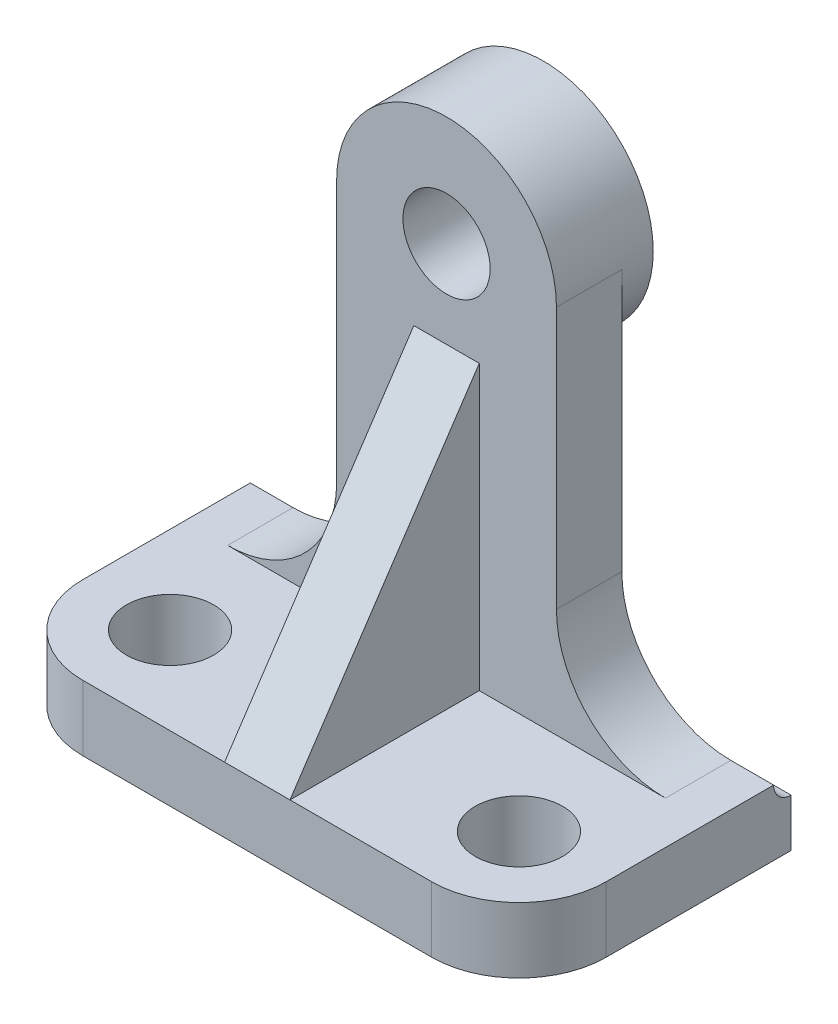
ISO-10303-21;
HEADER;
FILE_DESCRIPTION(('STEP AP214'),'2;1');
FILE_NAME('part.step','',(''),(''),'','','');
FILE_SCHEMA(('AUTOMOTIVE_DESIGN { 1 0 10303 214 1 1 1 1 }'));
ENDSEC;
DATA;
#1=APPLICATION_CONTEXT('core data for automotive mechanical design processes');
#2=APPLICATION_PROTOCOL_DEFINITION('international standard','automotive_design',2000,#1);
#3=PRODUCT_CONTEXT('',#1,'mechanical');
#4=PRODUCT('Part','Part','',(#3));
#5=PRODUCT_RELATED_PRODUCT_CATEGORY('part','',(#4));
#6=PRODUCT_DEFINITION_FORMATION('','',#4);
#7=PRODUCT_DEFINITION_CONTEXT('part definition',#1,'design');
#8=PRODUCT_DEFINITION('design','',#6,#7);
#9=PRODUCT_DEFINITION_SHAPE('','',#8);
#10=(LENGTH_UNIT() NAMED_UNIT(*) SI_UNIT(.MILLI.,.METRE.));
#11=(NAMED_UNIT(*) PLANE_ANGLE_UNIT() SI_UNIT($,.RADIAN.));
#12=(NAMED_UNIT(*) SI_UNIT($,.STERADIAN.) SOLID_ANGLE_UNIT());
#13=UNCERTAINTY_MEASURE_WITH_UNIT(LENGTH_MEASURE(1.E-05),#10,'distance_accuracy_value','');
#14=(GEOMETRIC_REPRESENTATION_CONTEXT(3) GLOBAL_UNCERTAINTY_ASSIGNED_CONTEXT((#13)) GLOBAL_UNIT_ASSIGNED_CONTEXT((#10,
#11,#12)) REPRESENTATION_CONTEXT('',''));
#15=CARTESIAN_POINT('',(0.,0.,0.));
#16=DIRECTION('',(0.,0.,1.));
#17=DIRECTION('',(1.,0.,0.));
#18=AXIS2_PLACEMENT_3D('',#15,#16,#17);
#19=CARTESIAN_POINT('',(38.1,0.,0.));
#20=DIRECTION('',(0.,-1.,0.));
#21=DIRECTION('',(0.,0.,-1.));
#22=AXIS2_PLACEMENT_3D('',#19,#20,#21);
#23=PLANE('',#22);
#24=CARTESIAN_POINT('',(25.4,0.,24.384));
#25=DIRECTION('',(0.,1.,0.));
#26=DIRECTION('',(0.,0.,1.));
#27=AXIS2_PLACEMENT_3D('',#24,#25,#26);
#28=CIRCLE('',#27,6.35);
#29=CARTESIAN_POINT('',(25.4,0.,30.734));
#30=VERTEX_POINT('',#29);
#31=EDGE_CURVE('E450',#30,#30,#28,.T.);
#32=ORIENTED_EDGE('',*,*,#31,.F.);
#33=EDGE_LOOP('',(#32));
#34=FACE_BOUND('',#33,.T.);
#35=DIRECTION('',(-1.,0.,0.));
#36=VECTOR('',#35,1.);
#37=CARTESIAN_POINT('',(38.1,0.,37.084));
#38=LINE('',#37,#36);
#39=CARTESIAN_POINT('',(25.4,0.,37.084));
#40=VERTEX_POINT('',#39);
#41=CARTESIAN_POINT('',(4.7625,0.,37.084));
#42=VERTEX_POINT('',#41);
#43=EDGE_CURVE('E262',#40,#42,#38,.T.);
#44=ORIENTED_EDGE('',*,*,#43,.F.);
#45=CARTESIAN_POINT('',(25.4,0.,24.384));
#46=DIRECTION('',(0.,-1.,0.));
#47=DIRECTION('',(0.,0.,-1.));
#48=AXIS2_PLACEMENT_3D('',#45,#46,#47);
#49=CIRCLE('',#48,12.7);
#50=CARTESIAN_POINT('',(38.1,0.,24.384));
#51=VERTEX_POINT('',#50);
#52=EDGE_CURVE('E11',#40,#51,#49,.F.);
#53=ORIENTED_EDGE('',*,*,#52,.T.);
#54=DIRECTION('',(0.,0.,1.));
#55=VECTOR('',#54,1.);
#56=CARTESIAN_POINT('',(38.1,0.,0.));
#57=LINE('',#56,#55);
#58=CARTESIAN_POINT('',(38.1,0.,0.));
#59=VERTEX_POINT('',#58);
#60=EDGE_CURVE('E228',#59,#51,#57,.T.);
#61=ORIENTED_EDGE('',*,*,#60,.F.);
#62=DIRECTION('',(-1.,0.,0.));
#63=VECTOR('',#62,1.);
#64=CARTESIAN_POINT('',(38.1,0.,0.));
#65=LINE('',#64,#63);
#66=CARTESIAN_POINT('',(31.877,0.,0.));
#67=VERTEX_POINT('',#66);
#68=EDGE_CURVE('E266',#59,#67,#65,.T.);
#69=ORIENTED_EDGE('',*,*,#68,.T.);
#70=DIRECTION('',(0.,0.,-1.));
#71=VECTOR('',#70,1.);
#72=CARTESIAN_POINT('',(31.877,0.,9.525));
#73=LINE('',#72,#71);
#74=CARTESIAN_POINT('',(31.877,0.,9.525));
#75=VERTEX_POINT('',#74);
#76=EDGE_CURVE('E285',#67,#75,#73,.F.);
#77=ORIENTED_EDGE('',*,*,#76,.T.);
#78=DIRECTION('',(1.,0.,0.));
#79=VECTOR('',#78,1.);
#80=CARTESIAN_POINT('',(-16.002,0.,9.525));
#81=LINE('',#80,#79);
#82=CARTESIAN_POINT('',(4.7625,0.,9.525));
#83=VERTEX_POINT('',#82);
#84=EDGE_CURVE('E196',#83,#75,#81,.T.);
#85=ORIENTED_EDGE('',*,*,#84,.F.);
#86=DIRECTION('',(0.,0.,-1.));
#87=VECTOR('',#86,1.);
#88=CARTESIAN_POINT('',(4.7625,0.,37.084));
#89=LINE('',#88,#87);
#90=EDGE_CURVE('E166',#42,#83,#89,.T.);
#91=ORIENTED_EDGE('',*,*,#90,.F.);
#92=EDGE_LOOP('',(#44,#53,#61,#69,#77,#85,#91));
#93=FACE_BOUND('',#92,.T.);
#94=ADVANCED_FACE('F40',(#34,#93),#23,.F.);
#95=CARTESIAN_POINT('',(0.,53.975,9.525));
#96=DIRECTION('',(0.,0.,-1.));
#97=DIRECTION('',(-1.,0.,0.));
#98=AXIS2_PLACEMENT_3D('',#95,#96,#97);
#99=PLANE('',#98);
#100=CARTESIAN_POINT('',(0.,53.975,9.525));
#101=DIRECTION('',(0.,0.,1.));
#102=DIRECTION('',(1.,0.,0.));
#103=AXIS2_PLACEMENT_3D('',#100,#101,#102);
#104=CIRCLE('',#103,6.34999999999999);
#105=CARTESIAN_POINT('',(6.34999999999999,53.975,9.525));
#106=VERTEX_POINT('',#105);
#107=EDGE_CURVE('E453',#106,#106,#104,.T.);
#108=ORIENTED_EDGE('',*,*,#107,.F.);
#109=EDGE_LOOP('',(#108));
#110=FACE_BOUND('',#109,.T.);
#111=DIRECTION('',(0.,1.,0.));
#112=VECTOR('',#111,1.);
#113=CARTESIAN_POINT('',(4.7625,0.,9.525));
#114=LINE('',#113,#112);
#115=CARTESIAN_POINT('',(4.7625,41.275,9.525));
#116=VERTEX_POINT('',#115);
#117=EDGE_CURVE('E167',#83,#116,#114,.T.);
#118=ORIENTED_EDGE('',*,*,#117,.F.);
#119=ORIENTED_EDGE('',*,*,#84,.T.);
#120=CARTESIAN_POINT('',(31.877,15.875,9.525));
#121=DIRECTION('',(0.,0.,-1.));
#122=DIRECTION('',(-1.,0.,0.));
#123=AXIS2_PLACEMENT_3D('',#120,#121,#122);
#124=CIRCLE('',#123,15.875);
#125=CARTESIAN_POINT('',(16.002,15.875,9.525));
#126=VERTEX_POINT('',#125);
#127=EDGE_CURVE('E300',#75,#126,#124,.T.);
#128=ORIENTED_EDGE('',*,*,#127,.T.);
#129=DIRECTION('',(0.,1.,0.));
#130=VECTOR('',#129,1.);
#131=CARTESIAN_POINT('',(16.002,53.975,9.525));
#132=LINE('',#131,#130);
#133=CARTESIAN_POINT('',(16.002,53.975,9.525));
#134=VERTEX_POINT('',#133);
#135=EDGE_CURVE('E201',#126,#134,#132,.T.);
#136=ORIENTED_EDGE('',*,*,#135,.T.);
#137=CARTESIAN_POINT('',(0.,53.975,9.525));
#138=DIRECTION('',(0.,0.,1.));
#139=DIRECTION('',(-1.,0.,0.));
#140=AXIS2_PLACEMENT_3D('',#137,#138,#139);
#141=CIRCLE('',#140,16.002);
#142=CARTESIAN_POINT('',(-16.002,53.975,9.525));
#143=VERTEX_POINT('',#142);
#144=EDGE_CURVE('E204',#134,#143,#141,.T.);
#145=ORIENTED_EDGE('',*,*,#144,.T.);
#146=DIRECTION('',(0.,-1.,0.));
#147=VECTOR('',#146,1.);
#148=CARTESIAN_POINT('',(-16.002,0.,9.525));
#149=LINE('',#148,#147);
#150=CARTESIAN_POINT('',(-16.002,15.875,9.525));
#151=VERTEX_POINT('',#150);
#152=EDGE_CURVE('E192',#143,#151,#149,.T.);
#153=ORIENTED_EDGE('',*,*,#152,.T.);
#154=CARTESIAN_POINT('',(-31.877,15.875,9.525));
#155=DIRECTION('',(0.,0.,-1.));
#156=DIRECTION('',(-1.,0.,0.));
#157=AXIS2_PLACEMENT_3D('',#154,#155,#156);
#158=CIRCLE('',#157,15.875);
#159=CARTESIAN_POINT('',(-31.877,0.,9.525));
#160=VERTEX_POINT('',#159);
#161=EDGE_CURVE('E292',#151,#160,#158,.T.);
#162=ORIENTED_EDGE('',*,*,#161,.T.);
#163=CARTESIAN_POINT('',(-4.7625,0.,9.525));
#164=VERTEX_POINT('',#163);
#165=EDGE_CURVE('E198',#160,#164,#81,.T.);
#166=ORIENTED_EDGE('',*,*,#165,.T.);
#167=DIRECTION('',(0.,1.,0.));
#168=VECTOR('',#167,1.);
#169=CARTESIAN_POINT('',(-4.7625,0.,9.525));
#170=LINE('',#169,#168);
#171=CARTESIAN_POINT('',(-4.7625,41.275,9.525));
#172=VERTEX_POINT('',#171);
#173=EDGE_CURVE('E179',#164,#172,#170,.T.);
#174=ORIENTED_EDGE('',*,*,#173,.T.);
#175=DIRECTION('',(-1.,0.,0.));
#176=VECTOR('',#175,1.);
#177=CARTESIAN_POINT('',(4.7625,41.275,9.525));
#178=LINE('',#177,#176);
#179=EDGE_CURVE('E159',#116,#172,#178,.T.);
#180=ORIENTED_EDGE('',*,*,#179,.F.);
#181=EDGE_LOOP('',(#118,#119,#128,#136,#145,#153,#162,#166,#174,#180));
#182=FACE_BOUND('',#181,.T.);
#183=ADVANCED_FACE('F177',(#110,#182),#99,.F.);
#184=CARTESIAN_POINT('',(0.,53.975,0.));
#185=DIRECTION('',(0.,0.,-1.));
#186=DIRECTION('',(-1.,0.,0.));
#187=AXIS2_PLACEMENT_3D('',#184,#185,#186);
#188=PLANE('',#187);
#189=DIRECTION('',(0.,-1.,0.));
#190=VECTOR('',#189,1.);
#191=CARTESIAN_POINT('',(-16.002,0.,0.));
#192=LINE('',#191,#190);
#193=CARTESIAN_POINT('',(-16.002,53.975,0.));
#194=VERTEX_POINT('',#193);
#195=CARTESIAN_POINT('',(-16.002,15.875,0.));
#196=VERTEX_POINT('',#195);
#197=EDGE_CURVE('E187',#194,#196,#192,.T.);
#198=ORIENTED_EDGE('',*,*,#197,.F.);
#199=CARTESIAN_POINT('',(0.,53.975,0.));
#200=DIRECTION('',(0.,0.,-1.));
#201=DIRECTION('',(-1.,0.,0.));
#202=AXIS2_PLACEMENT_3D('',#199,#200,#201);
#203=CIRCLE('',#202,16.002);
#204=CARTESIAN_POINT('',(16.002,53.975,0.));
#205=VERTEX_POINT('',#204);
#206=EDGE_CURVE('E270',#194,#205,#203,.F.);
#207=ORIENTED_EDGE('',*,*,#206,.T.);
#208=DIRECTION('',(0.,1.,0.));
#209=VECTOR('',#208,1.);
#210=CARTESIAN_POINT('',(16.002,53.975,0.));
#211=LINE('',#210,#209);
#212=CARTESIAN_POINT('',(16.002,15.875,0.));
#213=VERTEX_POINT('',#212);
#214=EDGE_CURVE('E197',#213,#205,#211,.T.);
#215=ORIENTED_EDGE('',*,*,#214,.F.);
#216=CARTESIAN_POINT('',(31.877,15.875,0.));
#217=DIRECTION('',(0.,0.,-1.));
#218=DIRECTION('',(-1.,0.,0.));
#219=AXIS2_PLACEMENT_3D('',#216,#217,#218);
#220=CIRCLE('',#219,15.875);
#221=EDGE_CURVE('E296',#213,#67,#220,.F.);
#222=ORIENTED_EDGE('',*,*,#221,.T.);
#223=DIRECTION('',(1.,0.,0.));
#224=VECTOR('',#223,1.);
#225=CARTESIAN_POINT('',(-16.002,0.,0.));
#226=LINE('',#225,#224);
#227=CARTESIAN_POINT('',(-31.877,0.,0.));
#228=VERTEX_POINT('',#227);
#229=EDGE_CURVE('E211',#228,#67,#226,.T.);
#230=ORIENTED_EDGE('',*,*,#229,.F.);
#231=CARTESIAN_POINT('',(-31.877,15.875,0.));
#232=DIRECTION('',(0.,0.,-1.));
#233=DIRECTION('',(-1.,0.,0.));
#234=AXIS2_PLACEMENT_3D('',#231,#232,#233);
#235=CIRCLE('',#234,15.875);
#236=EDGE_CURVE('E289',#228,#196,#235,.F.);
#237=ORIENTED_EDGE('',*,*,#236,.T.);
#238=EDGE_LOOP('',(#198,#207,#215,#222,#230,#237));
#239=FACE_BOUND('',#238,.T.);
#240=ADVANCED_FACE('F347',(#239),#188,.T.);
#241=CARTESIAN_POINT('',(-25.4,0.,24.384));
#242=DIRECTION('',(0.,1.,0.));
#243=DIRECTION('',(0.,0.,1.));
#244=AXIS2_PLACEMENT_3D('',#241,#242,#243);
#245=CIRCLE('',#244,6.35);
#246=CARTESIAN_POINT('',(-25.4,0.,30.734));
#247=VERTEX_POINT('',#246);
#248=EDGE_CURVE('E440',#247,#247,#245,.T.);
#249=ORIENTED_EDGE('',*,*,#248,.F.);
#250=EDGE_LOOP('',(#249));
#251=FACE_BOUND('',#250,.T.);
#252=DIRECTION('',(0.,0.,1.));
#253=VECTOR('',#252,1.);
#254=CARTESIAN_POINT('',(-38.1,0.,0.));
#255=LINE('',#254,#253);
#256=CARTESIAN_POINT('',(-38.1,0.,0.));
#257=VERTEX_POINT('',#256);
#258=CARTESIAN_POINT('',(-38.1,0.,24.384));
#259=VERTEX_POINT('',#258);
#260=EDGE_CURVE('E242',#257,#259,#255,.T.);
#261=ORIENTED_EDGE('',*,*,#260,.T.);
#262=CARTESIAN_POINT('',(-25.4,0.,24.384));
#263=DIRECTION('',(0.,-1.,0.));
#264=DIRECTION('',(0.,0.,-1.));
#265=AXIS2_PLACEMENT_3D('',#262,#263,#264);
#266=CIRCLE('',#265,12.7);
#267=CARTESIAN_POINT('',(-25.4,0.,37.084));
#268=VERTEX_POINT('',#267);
#269=EDGE_CURVE('E318',#259,#268,#266,.F.);
#270=ORIENTED_EDGE('',*,*,#269,.T.);
#271=CARTESIAN_POINT('',(-4.7625,0.,37.084));
#272=VERTEX_POINT('',#271);
#273=EDGE_CURVE('E261',#272,#268,#38,.T.);
#274=ORIENTED_EDGE('',*,*,#273,.F.);
#275=DIRECTION('',(0.,0.,-1.));
#276=VECTOR('',#275,1.);
#277=CARTESIAN_POINT('',(-4.7625,0.,37.084));
#278=LINE('',#277,#276);
#279=EDGE_CURVE('E174',#272,#164,#278,.T.);
#280=ORIENTED_EDGE('',*,*,#279,.T.);
#281=ORIENTED_EDGE('',*,*,#165,.F.);
#282=DIRECTION('',(0.,0.,-1.));
#283=VECTOR('',#282,1.);
#284=CARTESIAN_POINT('',(-31.877,0.,0.));
#285=LINE('',#284,#283);
#286=EDGE_CURVE('E274',#160,#228,#285,.T.);
#287=ORIENTED_EDGE('',*,*,#286,.T.);
#288=EDGE_CURVE('E265',#228,#257,#65,.T.);
#289=ORIENTED_EDGE('',*,*,#288,.T.);
#290=EDGE_LOOP('',(#261,#270,#274,#280,#281,#287,#289));
#291=FACE_BOUND('',#290,.T.);
#292=ADVANCED_FACE('F369',(#251,#291),#23,.F.);
#293=CARTESIAN_POINT('',(38.1,0.,-2.54));
#294=DIRECTION('',(-1.,0.,0.));
#295=DIRECTION('',(0.,0.,1.));
#296=AXIS2_PLACEMENT_3D('',#293,#294,#295);
#297=CYLINDRICAL_SURFACE('',#296,2.54);
#298=CARTESIAN_POINT('',(-38.1,0.,-2.54));
#299=DIRECTION('',(-1.,0.,0.));
#300=DIRECTION('',(0.,0.,1.));
#301=AXIS2_PLACEMENT_3D('',#298,#299,#300);
#302=CIRCLE('',#301,2.54);
#303=CARTESIAN_POINT('',(-38.1,-2.54,-2.54));
#304=VERTEX_POINT('',#303);
#305=EDGE_CURVE('E223',#304,#257,#302,.T.);
#306=ORIENTED_EDGE('',*,*,#305,.T.);
#307=ORIENTED_EDGE('',*,*,#288,.F.);
#308=ORIENTED_EDGE('',*,*,#229,.T.);
#309=ORIENTED_EDGE('',*,*,#68,.F.);
#310=CARTESIAN_POINT('',(38.1,0.,-2.54));
#311=DIRECTION('',(-1.,0.,0.));
#312=DIRECTION('',(0.,0.,1.));
#313=AXIS2_PLACEMENT_3D('',#310,#311,#312);
#314=CIRCLE('',#313,2.54);
#315=CARTESIAN_POINT('',(38.1,-2.54,-2.54));
#316=VERTEX_POINT('',#315);
#317=EDGE_CURVE('E224',#316,#59,#314,.T.);
#318=ORIENTED_EDGE('',*,*,#317,.F.);
#319=DIRECTION('',(-1.,0.,0.));
#320=VECTOR('',#319,1.);
#321=CARTESIAN_POINT('',(38.1,-2.54,-2.54));
#322=LINE('',#321,#320);
#323=EDGE_CURVE('E238',#316,#304,#322,.T.);
#324=ORIENTED_EDGE('',*,*,#323,.T.);
#325=EDGE_LOOP('',(#306,#307,#308,#309,#318,#324));
#326=FACE_BOUND('',#325,.T.);
#327=ADVANCED_FACE('F340',(#326),#297,.F.);
#328=CARTESIAN_POINT('',(38.1,0.,37.084));
#329=DIRECTION('',(0.,0.,-1.));
#330=DIRECTION('',(-1.,0.,0.));
#331=AXIS2_PLACEMENT_3D('',#328,#329,#330);
#332=PLANE('',#331);
#333=ORIENTED_EDGE('',*,*,#273,.T.);
#334=DIRECTION('',(0.,-1.,0.));
#335=VECTOR('',#334,1.);
#336=CARTESIAN_POINT('',(-25.4,-9.525,37.084));
#337=LINE('',#336,#335);
#338=CARTESIAN_POINT('',(-25.4,-9.525,37.084));
#339=VERTEX_POINT('',#338);
#340=EDGE_CURVE('E306',#268,#339,#337,.T.);
#341=ORIENTED_EDGE('',*,*,#340,.T.);
#342=DIRECTION('',(-1.,0.,0.));
#343=VECTOR('',#342,1.);
#344=CARTESIAN_POINT('',(38.1,-9.525,37.084));
#345=LINE('',#344,#343);
#346=CARTESIAN_POINT('',(25.4,-9.525,37.084));
#347=VERTEX_POINT('',#346);
#348=EDGE_CURVE('E257',#347,#339,#345,.T.);
#349=ORIENTED_EDGE('',*,*,#348,.F.);
#350=DIRECTION('',(0.,-1.,0.));
#351=VECTOR('',#350,1.);
#352=CARTESIAN_POINT('',(25.4,0.,37.084));
#353=LINE('',#352,#351);
#354=EDGE_CURVE('E303',#347,#40,#353,.F.);
#355=ORIENTED_EDGE('',*,*,#354,.T.);
#356=ORIENTED_EDGE('',*,*,#43,.T.);
#357=DIRECTION('',(-1.,0.,0.));
#358=VECTOR('',#357,1.);
#359=CARTESIAN_POINT('',(4.7625,0.,37.084));
#360=LINE('',#359,#358);
#361=EDGE_CURVE('E162',#42,#272,#360,.T.);
#362=ORIENTED_EDGE('',*,*,#361,.T.);
#363=EDGE_LOOP('',(#333,#341,#349,#355,#356,#362));
#364=FACE_BOUND('',#363,.T.);
#365=ADVANCED_FACE('F405',(#364),#332,.F.);
#366=CARTESIAN_POINT('',(38.1,-9.525,37.084));
#367=DIRECTION('',(0.,1.,0.));
#368=DIRECTION('',(0.,0.,1.));
#369=AXIS2_PLACEMENT_3D('',#366,#367,#368);
#370=PLANE('',#369);
#371=CARTESIAN_POINT('',(-25.4,-9.525,24.384));
#372=DIRECTION('',(0.,1.,0.));
#373=DIRECTION('',(0.,0.,1.));
#374=AXIS2_PLACEMENT_3D('',#371,#372,#373);
#375=CIRCLE('',#374,6.35);
#376=CARTESIAN_POINT('',(-25.4,-9.525,30.734));
#377=VERTEX_POINT('',#376);
#378=EDGE_CURVE('E443',#377,#377,#375,.T.);
#379=ORIENTED_EDGE('',*,*,#378,.T.);
#380=EDGE_LOOP('',(#379));
#381=FACE_BOUND('',#380,.T.);
#382=CARTESIAN_POINT('',(25.4,-9.525,24.384));
#383=DIRECTION('',(0.,1.,0.));
#384=DIRECTION('',(0.,0.,1.));
#385=AXIS2_PLACEMENT_3D('',#382,#383,#384);
#386=CIRCLE('',#385,6.35);
#387=CARTESIAN_POINT('',(25.4,-9.525,30.734));
#388=VERTEX_POINT('',#387);
#389=EDGE_CURVE('E460',#388,#388,#386,.T.);
#390=ORIENTED_EDGE('',*,*,#389,.T.);
#391=EDGE_LOOP('',(#390));
#392=FACE_BOUND('',#391,.T.);
#393=ORIENTED_EDGE('',*,*,#348,.T.);
#394=CARTESIAN_POINT('',(-25.4,-9.525,24.384));
#395=DIRECTION('',(0.,1.,0.));
#396=DIRECTION('',(0.,0.,1.));
#397=AXIS2_PLACEMENT_3D('',#394,#395,#396);
#398=CIRCLE('',#397,12.7);
#399=CARTESIAN_POINT('',(-38.1,-9.525,24.384));
#400=VERTEX_POINT('',#399);
#401=EDGE_CURVE('E313',#339,#400,#398,.F.);
#402=ORIENTED_EDGE('',*,*,#401,.T.);
#403=DIRECTION('',(0.,0.,-1.));
#404=VECTOR('',#403,1.);
#405=CARTESIAN_POINT('',(-38.1,-9.525,37.084));
#406=LINE('',#405,#404);
#407=CARTESIAN_POINT('',(-38.1,-9.525,-2.54));
#408=VERTEX_POINT('',#407);
#409=EDGE_CURVE('E245',#400,#408,#406,.T.);
#410=ORIENTED_EDGE('',*,*,#409,.T.);
#411=DIRECTION('',(-1.,0.,0.));
#412=VECTOR('',#411,1.);
#413=CARTESIAN_POINT('',(38.1,-9.525,-2.54));
#414=LINE('',#413,#412);
#415=CARTESIAN_POINT('',(38.1,-9.525,-2.54));
#416=VERTEX_POINT('',#415);
#417=EDGE_CURVE('E253',#416,#408,#414,.T.);
#418=ORIENTED_EDGE('',*,*,#417,.F.);
#419=DIRECTION('',(0.,0.,-1.));
#420=VECTOR('',#419,1.);
#421=CARTESIAN_POINT('',(38.1,-9.525,37.084));
#422=LINE('',#421,#420);
#423=CARTESIAN_POINT('',(38.1,-9.525,24.384));
#424=VERTEX_POINT('',#423);
#425=EDGE_CURVE('E232',#424,#416,#422,.T.);
#426=ORIENTED_EDGE('',*,*,#425,.F.);
#427=CARTESIAN_POINT('',(25.4,-9.525,24.384));
#428=DIRECTION('',(0.,1.,0.));
#429=DIRECTION('',(0.,0.,1.));
#430=AXIS2_PLACEMENT_3D('',#427,#428,#429);
#431=CIRCLE('',#430,12.7);
#432=EDGE_CURVE('E310',#424,#347,#431,.F.);
#433=ORIENTED_EDGE('',*,*,#432,.T.);
#434=EDGE_LOOP('',(#393,#402,#410,#418,#426,#433));
#435=FACE_BOUND('',#434,.T.);
#436=ADVANCED_FACE('F330',(#381,#392,#435),#370,.F.);
#437=CARTESIAN_POINT('',(38.1,-9.525,-2.54));
#438=DIRECTION('',(0.,0.,1.));
#439=DIRECTION('',(1.,0.,0.));
#440=AXIS2_PLACEMENT_3D('',#437,#438,#439);
#441=PLANE('',#440);
#442=DIRECTION('',(0.,1.,0.));
#443=VECTOR('',#442,1.);
#444=CARTESIAN_POINT('',(-38.1,-9.525,-2.54));
#445=LINE('',#444,#443);
#446=EDGE_CURVE('E229',#408,#304,#445,.T.);
#447=ORIENTED_EDGE('',*,*,#446,.T.);
#448=ORIENTED_EDGE('',*,*,#323,.F.);
#449=DIRECTION('',(0.,1.,0.));
#450=VECTOR('',#449,1.);
#451=CARTESIAN_POINT('',(38.1,-9.525,-2.54));
#452=LINE('',#451,#450);
#453=EDGE_CURVE('E235',#416,#316,#452,.T.);
#454=ORIENTED_EDGE('',*,*,#453,.F.);
#455=ORIENTED_EDGE('',*,*,#417,.T.);
#456=EDGE_LOOP('',(#447,#448,#454,#455));
#457=FACE_BOUND('',#456,.T.);
#458=ADVANCED_FACE('F336',(#457),#441,.F.);
#459=CARTESIAN_POINT('',(38.1,0.,-2.54));
#460=DIRECTION('',(-1.,0.,0.));
#461=DIRECTION('',(0.,0.,1.));
#462=AXIS2_PLACEMENT_3D('',#459,#460,#461);
#463=PLANE('',#462);
#464=ORIENTED_EDGE('',*,*,#60,.T.);
#465=DIRECTION('',(0.,-1.,0.));
#466=VECTOR('',#465,1.);
#467=CARTESIAN_POINT('',(38.1,0.,24.384));
#468=LINE('',#467,#466);
#469=EDGE_CURVE('E49',#51,#424,#468,.T.);
#470=ORIENTED_EDGE('',*,*,#469,.T.);
#471=ORIENTED_EDGE('',*,*,#425,.T.);
#472=ORIENTED_EDGE('',*,*,#453,.T.);
#473=ORIENTED_EDGE('',*,*,#317,.T.);
#474=EDGE_LOOP('',(#464,#470,#471,#472,#473));
#475=FACE_BOUND('',#474,.T.);
#476=ADVANCED_FACE('F326',(#475),#463,.F.);
#477=CARTESIAN_POINT('',(-38.1,0.,-2.54));
#478=DIRECTION('',(-1.,0.,0.));
#479=DIRECTION('',(0.,0.,1.));
#480=AXIS2_PLACEMENT_3D('',#477,#478,#479);
#481=PLANE('',#480);
#482=ORIENTED_EDGE('',*,*,#409,.F.);
#483=DIRECTION('',(0.,-1.,0.));
#484=VECTOR('',#483,1.);
#485=CARTESIAN_POINT('',(-38.1,0.,24.384));
#486=LINE('',#485,#484);
#487=EDGE_CURVE('E62',#400,#259,#486,.F.);
#488=ORIENTED_EDGE('',*,*,#487,.T.);
#489=ORIENTED_EDGE('',*,*,#260,.F.);
#490=ORIENTED_EDGE('',*,*,#305,.F.);
#491=ORIENTED_EDGE('',*,*,#446,.F.);
#492=EDGE_LOOP('',(#482,#488,#489,#490,#491));
#493=FACE_BOUND('',#492,.T.);
#494=ADVANCED_FACE('F409',(#493),#481,.T.);
#495=CARTESIAN_POINT('',(-16.002,0.,9.525));
#496=DIRECTION('',(1.,0.,0.));
#497=DIRECTION('',(0.,1.,0.));
#498=AXIS2_PLACEMENT_3D('',#495,#496,#497);
#499=PLANE('',#498);
#500=ORIENTED_EDGE('',*,*,#197,.T.);
#501=DIRECTION('',(0.,0.,-1.));
#502=VECTOR('',#501,1.);
#503=CARTESIAN_POINT('',(-16.002,15.875,9.525));
#504=LINE('',#503,#502);
#505=EDGE_CURVE('E278',#196,#151,#504,.F.);
#506=ORIENTED_EDGE('',*,*,#505,.T.);
#507=ORIENTED_EDGE('',*,*,#152,.F.);
#508=DIRECTION('',(0.,0.,-1.));
#509=VECTOR('',#508,1.);
#510=CARTESIAN_POINT('',(-16.002,53.975,9.525));
#511=LINE('',#510,#509);
#512=EDGE_CURVE('E207',#143,#194,#511,.T.);
#513=ORIENTED_EDGE('',*,*,#512,.T.);
#514=EDGE_LOOP('',(#500,#506,#507,#513));
#515=FACE_BOUND('',#514,.T.);
#516=ADVANCED_FACE('F411',(#515),#499,.F.);
#517=CARTESIAN_POINT('',(16.002,53.975,9.525));
#518=DIRECTION('',(-1.,0.,0.));
#519=DIRECTION('',(0.,-1.,0.));
#520=AXIS2_PLACEMENT_3D('',#517,#518,#519);
#521=PLANE('',#520);
#522=ORIENTED_EDGE('',*,*,#135,.F.);
#523=DIRECTION('',(0.,0.,-1.));
#524=VECTOR('',#523,1.);
#525=CARTESIAN_POINT('',(16.002,15.875,0.));
#526=LINE('',#525,#524);
#527=EDGE_CURVE('E281',#126,#213,#526,.T.);
#528=ORIENTED_EDGE('',*,*,#527,.T.);
#529=ORIENTED_EDGE('',*,*,#214,.T.);
#530=DIRECTION('',(0.,0.,-1.));
#531=VECTOR('',#530,1.);
#532=CARTESIAN_POINT('',(16.002,53.975,9.525));
#533=LINE('',#532,#531);
#534=EDGE_CURVE('E219',#134,#205,#533,.T.);
#535=ORIENTED_EDGE('',*,*,#534,.F.);
#536=EDGE_LOOP('',(#522,#528,#529,#535));
#537=FACE_BOUND('',#536,.T.);
#538=ADVANCED_FACE('F355',(#537),#521,.F.);
#539=CARTESIAN_POINT('',(0.,53.975,9.525));
#540=DIRECTION('',(0.,0.,-1.));
#541=DIRECTION('',(-1.,0.,0.));
#542=AXIS2_PLACEMENT_3D('',#539,#540,#541);
#543=CYLINDRICAL_SURFACE('',#542,16.002);
#544=ORIENTED_EDGE('',*,*,#534,.T.);
#545=ORIENTED_EDGE('',*,*,#206,.F.);
#546=ORIENTED_EDGE('',*,*,#512,.F.);
#547=ORIENTED_EDGE('',*,*,#144,.F.);
#548=EDGE_LOOP('',(#544,#545,#546,#547));
#549=FACE_BOUND('',#548,.T.);
#550=CARTESIAN_POINT('',(0.,53.975,-4.572));
#551=DIRECTION('',(0.,0.,-1.));
#552=DIRECTION('',(-1.,0.,0.));
#553=AXIS2_PLACEMENT_3D('',#550,#551,#552);
#554=CIRCLE('',#553,16.002);
#555=CARTESIAN_POINT('',(-16.002,53.975,-4.572));
#556=VERTEX_POINT('',#555);
#557=EDGE_CURVE('E181',#556,#556,#554,.T.);
#558=ORIENTED_EDGE('',*,*,#557,.F.);
#559=EDGE_LOOP('',(#558));
#560=FACE_BOUND('',#559,.T.);
#561=ADVANCED_FACE('F359',(#549,#560),#543,.T.);
#562=CARTESIAN_POINT('',(0.,53.975,-4.572));
#563=DIRECTION('',(0.,0.,-1.));
#564=DIRECTION('',(-1.,0.,0.));
#565=AXIS2_PLACEMENT_3D('',#562,#563,#564);
#566=PLANE('',#565);
#567=CARTESIAN_POINT('',(0.,53.975,-4.572));
#568=DIRECTION('',(0.,0.,1.));
#569=DIRECTION('',(1.,0.,0.));
#570=AXIS2_PLACEMENT_3D('',#567,#568,#569);
#571=CIRCLE('',#570,6.35);
#572=CARTESIAN_POINT('',(6.35,53.975,-4.572));
#573=VERTEX_POINT('',#572);
#574=EDGE_CURVE('E444',#573,#573,#571,.T.);
#575=ORIENTED_EDGE('',*,*,#574,.T.);
#576=EDGE_LOOP('',(#575));
#577=FACE_BOUND('',#576,.T.);
#578=ORIENTED_EDGE('',*,*,#557,.T.);
#579=EDGE_LOOP('',(#578));
#580=FACE_BOUND('',#579,.T.);
#581=ADVANCED_FACE('F487',(#577,#580),#566,.T.);
#582=CARTESIAN_POINT('',(4.7625,41.275,9.525));
#583=DIRECTION('',(0.,-0.555290581777434,-0.831656401279567));
#584=DIRECTION('',(0.,0.831656401279567,-0.555290581777434));
#585=AXIS2_PLACEMENT_3D('',#582,#583,#584);
#586=PLANE('',#585);
#587=DIRECTION('',(0.,-0.831656401279566,0.555290581777434));
#588=VECTOR('',#587,1.);
#589=CARTESIAN_POINT('',(-4.7625,41.275,9.525));
#590=LINE('',#589,#588);
#591=EDGE_CURVE('E468',#172,#272,#590,.T.);
#592=ORIENTED_EDGE('',*,*,#591,.T.);
#593=ORIENTED_EDGE('',*,*,#361,.F.);
#594=DIRECTION('',(0.,-0.831656401279566,0.555290581777434));
#595=VECTOR('',#594,1.);
#596=CARTESIAN_POINT('',(4.7625,41.275,9.525));
#597=LINE('',#596,#595);
#598=EDGE_CURVE('E155',#116,#42,#597,.T.);
#599=ORIENTED_EDGE('',*,*,#598,.F.);
#600=ORIENTED_EDGE('',*,*,#179,.T.);
#601=EDGE_LOOP('',(#592,#593,#599,#600));
#602=FACE_BOUND('',#601,.T.);
#603=ADVANCED_FACE('F157',(#602),#586,.F.);
#604=CARTESIAN_POINT('',(4.7625,0.,0.));
#605=DIRECTION('',(-1.,0.,0.));
#606=DIRECTION('',(0.,0.,1.));
#607=AXIS2_PLACEMENT_3D('',#604,#605,#606);
#608=PLANE('',#607);
#609=ORIENTED_EDGE('',*,*,#117,.T.);
#610=ORIENTED_EDGE('',*,*,#598,.T.);
#611=ORIENTED_EDGE('',*,*,#90,.T.);
#612=EDGE_LOOP('',(#609,#610,#611));
#613=FACE_BOUND('',#612,.T.);
#614=ADVANCED_FACE('F170',(#613),#608,.F.);
#615=CARTESIAN_POINT('',(-4.7625,0.,0.));
#616=DIRECTION('',(-1.,0.,0.));
#617=DIRECTION('',(0.,0.,1.));
#618=AXIS2_PLACEMENT_3D('',#615,#616,#617);
#619=PLANE('',#618);
#620=ORIENTED_EDGE('',*,*,#173,.F.);
#621=ORIENTED_EDGE('',*,*,#279,.F.);
#622=ORIENTED_EDGE('',*,*,#591,.F.);
#623=EDGE_LOOP('',(#620,#621,#622));
#624=FACE_BOUND('',#623,.T.);
#625=ADVANCED_FACE('F474',(#624),#619,.T.);
#626=CARTESIAN_POINT('',(-31.877,15.875,0.));
#627=DIRECTION('',(0.,0.,1.));
#628=DIRECTION('',(0.,-1.,0.));
#629=AXIS2_PLACEMENT_3D('',#626,#627,#628);
#630=CYLINDRICAL_SURFACE('',#629,15.875);
#631=ORIENTED_EDGE('',*,*,#161,.F.);
#632=ORIENTED_EDGE('',*,*,#505,.F.);
#633=ORIENTED_EDGE('',*,*,#236,.F.);
#634=ORIENTED_EDGE('',*,*,#286,.F.);
#635=EDGE_LOOP('',(#631,#632,#633,#634));
#636=FACE_BOUND('',#635,.T.);
#637=ADVANCED_FACE('F367',(#636),#630,.F.);
#638=CARTESIAN_POINT('',(31.877,15.875,9.525));
#639=DIRECTION('',(0.,0.,1.));
#640=DIRECTION('',(0.,-1.,0.));
#641=AXIS2_PLACEMENT_3D('',#638,#639,#640);
#642=CYLINDRICAL_SURFACE('',#641,15.875);
#643=ORIENTED_EDGE('',*,*,#127,.F.);
#644=ORIENTED_EDGE('',*,*,#76,.F.);
#645=ORIENTED_EDGE('',*,*,#221,.F.);
#646=ORIENTED_EDGE('',*,*,#527,.F.);
#647=EDGE_LOOP('',(#643,#644,#645,#646));
#648=FACE_BOUND('',#647,.T.);
#649=ADVANCED_FACE('F351',(#648),#642,.F.);
#650=CARTESIAN_POINT('',(-25.4,0.,24.384));
#651=DIRECTION('',(0.,1.,0.));
#652=DIRECTION('',(0.,0.,1.));
#653=AXIS2_PLACEMENT_3D('',#650,#651,#652);
#654=CYLINDRICAL_SURFACE('',#653,12.7);
#655=ORIENTED_EDGE('',*,*,#269,.F.);
#656=ORIENTED_EDGE('',*,*,#487,.F.);
#657=ORIENTED_EDGE('',*,*,#401,.F.);
#658=ORIENTED_EDGE('',*,*,#340,.F.);
#659=EDGE_LOOP('',(#655,#656,#657,#658));
#660=FACE_BOUND('',#659,.T.);
#661=ADVANCED_FACE('F408',(#660),#654,.T.);
#662=CARTESIAN_POINT('',(25.4,0.,24.384));
#663=DIRECTION('',(0.,-1.,0.));
#664=DIRECTION('',(0.,0.,-1.));
#665=AXIS2_PLACEMENT_3D('',#662,#663,#664);
#666=CYLINDRICAL_SURFACE('',#665,12.7);
#667=ORIENTED_EDGE('',*,*,#52,.F.);
#668=ORIENTED_EDGE('',*,*,#354,.F.);
#669=ORIENTED_EDGE('',*,*,#432,.F.);
#670=ORIENTED_EDGE('',*,*,#469,.F.);
#671=EDGE_LOOP('',(#667,#668,#669,#670));
#672=FACE_BOUND('',#671,.T.);
#673=ADVANCED_FACE('F42',(#672),#666,.T.);
#674=CARTESIAN_POINT('',(25.4,0.,24.384));
#675=DIRECTION('',(0.,1.,0.));
#676=DIRECTION('',(0.,0.,1.));
#677=AXIS2_PLACEMENT_3D('',#674,#675,#676);
#678=CYLINDRICAL_SURFACE('',#677,6.35);
#679=ORIENTED_EDGE('',*,*,#389,.F.);
#680=EDGE_LOOP('',(#679));
#681=FACE_BOUND('',#680,.T.);
#682=ORIENTED_EDGE('',*,*,#31,.T.);
#683=EDGE_LOOP('',(#682));
#684=FACE_BOUND('',#683,.T.);
#685=ADVANCED_FACE('F551',(#681,#684),#678,.F.);
#686=CARTESIAN_POINT('',(-25.4,0.,24.384));
#687=DIRECTION('',(0.,1.,0.));
#688=DIRECTION('',(0.,0.,1.));
#689=AXIS2_PLACEMENT_3D('',#686,#687,#688);
#690=CYLINDRICAL_SURFACE('',#689,6.35);
#691=ORIENTED_EDGE('',*,*,#378,.F.);
#692=EDGE_LOOP('',(#691));
#693=FACE_BOUND('',#692,.T.);
#694=ORIENTED_EDGE('',*,*,#248,.T.);
#695=EDGE_LOOP('',(#694));
#696=FACE_BOUND('',#695,.T.);
#697=ADVANCED_FACE('F560',(#693,#696),#690,.F.);
#698=CARTESIAN_POINT('',(0.,53.975,9.525));
#699=DIRECTION('',(0.,0.,1.));
#700=DIRECTION('',(1.,0.,0.));
#701=AXIS2_PLACEMENT_3D('',#698,#699,#700);
#702=CYLINDRICAL_SURFACE('',#701,6.34999999999999);
#703=ORIENTED_EDGE('',*,*,#574,.F.);
#704=EDGE_LOOP('',(#703));
#705=FACE_BOUND('',#704,.T.);
#706=ORIENTED_EDGE('',*,*,#107,.T.);
#707=EDGE_LOOP('',(#706));
#708=FACE_BOUND('',#707,.T.);
#709=ADVANCED_FACE('F570',(#705,#708),#702,.F.);
#710=CLOSED_SHELL('',(#94,#183,#240,#292,#327,#365,#436,#458,#476,#494,#516,#538,#561,#581,#603,
#614,#625,#637,#649,#661,#673,#685,#697,#709));
#711=MANIFOLD_SOLID_BREP('B2',#710);
#712=ADVANCED_BREP_SHAPE_REPRESENTATION('',(#18,#711),#14);
#713=SHAPE_DEFINITION_REPRESENTATION(#9,#712);
ENDSEC;
END-ISO-10303-21;
